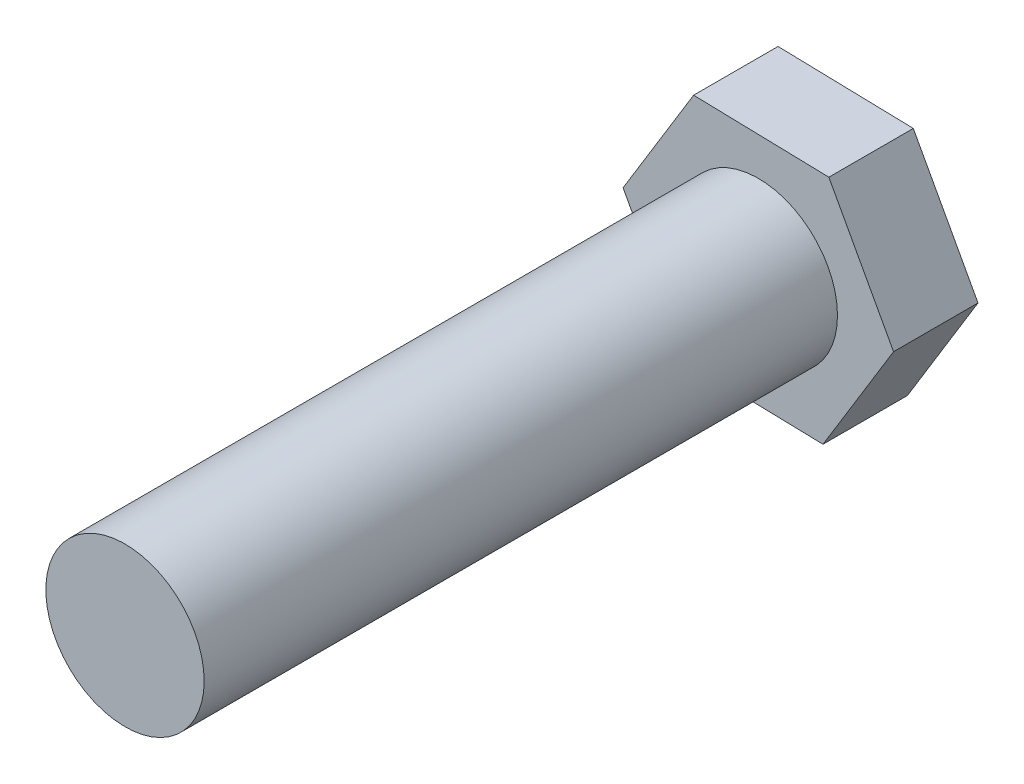
ISO-10303-21;
HEADER;
FILE_DESCRIPTION(('STEP AP214'),'2;1');
FILE_NAME('part.step','',(''),(''),'','','');
FILE_SCHEMA(('AUTOMOTIVE_DESIGN { 1 0 10303 214 1 1 1 1 }'));
ENDSEC;
DATA;
#1=APPLICATION_CONTEXT('core data for automotive mechanical design processes');
#2=APPLICATION_PROTOCOL_DEFINITION('international standard','automotive_design',2000,#1);
#3=PRODUCT_CONTEXT('',#1,'mechanical');
#4=PRODUCT('Part','Part','',(#3));
#5=PRODUCT_RELATED_PRODUCT_CATEGORY('part','',(#4));
#6=PRODUCT_DEFINITION_FORMATION('','',#4);
#7=PRODUCT_DEFINITION_CONTEXT('part definition',#1,'design');
#8=PRODUCT_DEFINITION('design','',#6,#7);
#9=PRODUCT_DEFINITION_SHAPE('','',#8);
#10=(LENGTH_UNIT() NAMED_UNIT(*) SI_UNIT(.MILLI.,.METRE.));
#11=(NAMED_UNIT(*) PLANE_ANGLE_UNIT() SI_UNIT($,.RADIAN.));
#12=(NAMED_UNIT(*) SI_UNIT($,.STERADIAN.) SOLID_ANGLE_UNIT());
#13=UNCERTAINTY_MEASURE_WITH_UNIT(LENGTH_MEASURE(1.E-05),#10,'distance_accuracy_value','');
#14=(GEOMETRIC_REPRESENTATION_CONTEXT(3) GLOBAL_UNCERTAINTY_ASSIGNED_CONTEXT((#13)) GLOBAL_UNIT_ASSIGNED_CONTEXT((#10,
#11,#12)) REPRESENTATION_CONTEXT('',''));
#15=CARTESIAN_POINT('',(0.,0.,0.));
#16=DIRECTION('',(0.,0.,1.));
#17=DIRECTION('',(1.,0.,0.));
#18=AXIS2_PLACEMENT_3D('',#15,#16,#17);
#19=CARTESIAN_POINT('',(8.13636466110673,-0.203403789280373,43.18));
#20=DIRECTION('',(-0.878250680315167,-0.478200525434619,0.));
#21=DIRECTION('',(0.478200525434619,-0.878250680315167,0.));
#22=AXIS2_PLACEMENT_3D('',#19,#20,#21);
#23=PLANE('',#22);
#24=DIRECTION('',(-0.478200525434619,0.878250680315167,0.));
#25=VECTOR('',#24,1.);
#26=CARTESIAN_POINT('',(8.13636466110673,-0.203403789280373,5.07999999999999));
#27=LINE('',#26,#25);
#28=CARTESIAN_POINT('',(8.13636466110673,-0.203403789280373,5.07999999999999));
#29=VERTEX_POINT('',#28);
#30=CARTESIAN_POINT('',(4.24433517929619,6.9445965963322,5.07999999999999));
#31=VERTEX_POINT('',#30);
#32=EDGE_CURVE('E83',#29,#31,#27,.T.);
#33=ORIENTED_EDGE('',*,*,#32,.F.);
#34=DIRECTION('',(0.,0.,-1.));
#35=VECTOR('',#34,1.);
#36=CARTESIAN_POINT('',(8.13636466110673,-0.203403789280373,43.18));
#37=LINE('',#36,#35);
#38=CARTESIAN_POINT('',(8.13636466110673,-0.203403789280373,0.));
#39=VERTEX_POINT('',#38);
#40=EDGE_CURVE('E53',#29,#39,#37,.T.);
#41=ORIENTED_EDGE('',*,*,#40,.T.);
#42=DIRECTION('',(-0.478200525434619,0.878250680315167,0.));
#43=VECTOR('',#42,1.);
#44=CARTESIAN_POINT('',(8.13636466110673,-0.203403789280373,0.));
#45=LINE('',#44,#43);
#46=CARTESIAN_POINT('',(4.24433517929619,6.9445965963322,0.));
#47=VERTEX_POINT('',#46);
#48=EDGE_CURVE('E88',#39,#47,#45,.T.);
#49=ORIENTED_EDGE('',*,*,#48,.T.);
#50=DIRECTION('',(0.,0.,-1.));
#51=VECTOR('',#50,1.);
#52=CARTESIAN_POINT('',(4.24433517929619,6.9445965963322,43.18));
#53=LINE('',#52,#51);
#54=EDGE_CURVE('E39',#31,#47,#53,.T.);
#55=ORIENTED_EDGE('',*,*,#54,.F.);
#56=EDGE_LOOP('',(#33,#41,#49,#55));
#57=FACE_BOUND('',#56,.T.);
#58=ADVANCED_FACE('F32',(#57),#23,.F.);
#59=CARTESIAN_POINT('',(4.24433517929619,6.9445965963322,43.18));
#60=DIRECTION('',(-0.0249915370281371,-0.99968766276121,0.));
#61=DIRECTION('',(0.99968766276121,-0.0249915370281371,0.));
#62=AXIS2_PLACEMENT_3D('',#59,#60,#61);
#63=PLANE('',#62);
#64=DIRECTION('',(-0.99968766276121,0.0249915370281371,0.));
#65=VECTOR('',#64,1.);
#66=CARTESIAN_POINT('',(4.24433517929619,6.9445965963322,5.07999999999999));
#67=LINE('',#66,#65);
#68=CARTESIAN_POINT('',(-3.89202948181054,7.14800038561258,5.07999999999999));
#69=VERTEX_POINT('',#68);
#70=EDGE_CURVE('E89',#31,#69,#67,.T.);
#71=ORIENTED_EDGE('',*,*,#70,.F.);
#72=ORIENTED_EDGE('',*,*,#54,.T.);
#73=DIRECTION('',(-0.99968766276121,0.0249915370281371,0.));
#74=VECTOR('',#73,1.);
#75=CARTESIAN_POINT('',(4.24433517929619,6.9445965963322,0.));
#76=LINE('',#75,#74);
#77=CARTESIAN_POINT('',(-3.89202948181054,7.14800038561258,0.));
#78=VERTEX_POINT('',#77);
#79=EDGE_CURVE('E112',#47,#78,#76,.T.);
#80=ORIENTED_EDGE('',*,*,#79,.T.);
#81=DIRECTION('',(0.,0.,-1.));
#82=VECTOR('',#81,1.);
#83=CARTESIAN_POINT('',(-3.89202948181054,7.14800038561258,43.18));
#84=LINE('',#83,#82);
#85=EDGE_CURVE('E106',#69,#78,#84,.T.);
#86=ORIENTED_EDGE('',*,*,#85,.F.);
#87=EDGE_LOOP('',(#71,#72,#80,#86));
#88=FACE_BOUND('',#87,.T.);
#89=ADVANCED_FACE('F110',(#88),#63,.F.);
#90=CARTESIAN_POINT('',(-3.89202948181054,7.14800038561258,43.18));
#91=DIRECTION('',(0.853259143287031,-0.521487137326591,0.));
#92=DIRECTION('',(0.521487137326591,0.853259143287031,0.));
#93=AXIS2_PLACEMENT_3D('',#90,#91,#92);
#94=PLANE('',#93);
#95=DIRECTION('',(-0.521487137326591,-0.853259143287031,0.));
#96=VECTOR('',#95,1.);
#97=CARTESIAN_POINT('',(-3.89202948181054,7.14800038561258,5.07999999999999));
#98=LINE('',#97,#96);
#99=CARTESIAN_POINT('',(-8.13636466110673,0.203403789280373,5.07999999999999));
#100=VERTEX_POINT('',#99);
#101=EDGE_CURVE('E139',#69,#100,#98,.T.);
#102=ORIENTED_EDGE('',*,*,#101,.F.);
#103=ORIENTED_EDGE('',*,*,#85,.T.);
#104=DIRECTION('',(-0.521487137326591,-0.853259143287031,0.));
#105=VECTOR('',#104,1.);
#106=CARTESIAN_POINT('',(-3.89202948181054,7.14800038561258,0.));
#107=LINE('',#106,#105);
#108=CARTESIAN_POINT('',(-8.13636466110673,0.203403789280373,0.));
#109=VERTEX_POINT('',#108);
#110=EDGE_CURVE('E118',#78,#109,#107,.T.);
#111=ORIENTED_EDGE('',*,*,#110,.T.);
#112=DIRECTION('',(0.,0.,-1.));
#113=VECTOR('',#112,1.);
#114=CARTESIAN_POINT('',(-8.13636466110673,0.203403789280373,43.18));
#115=LINE('',#114,#113);
#116=EDGE_CURVE('E104',#100,#109,#115,.T.);
#117=ORIENTED_EDGE('',*,*,#116,.F.);
#118=EDGE_LOOP('',(#102,#103,#111,#117));
#119=FACE_BOUND('',#118,.T.);
#120=ADVANCED_FACE('F138',(#119),#94,.F.);
#121=CARTESIAN_POINT('',(-8.13636466110673,0.203403789280373,43.18));
#122=DIRECTION('',(0.878250680315167,0.47820052543462,0.));
#123=DIRECTION('',(-0.47820052543462,0.878250680315167,0.));
#124=AXIS2_PLACEMENT_3D('',#121,#122,#123);
#125=PLANE('',#124);
#126=DIRECTION('',(0.47820052543462,-0.878250680315167,0.));
#127=VECTOR('',#126,1.);
#128=CARTESIAN_POINT('',(-8.13636466110673,0.203403789280373,5.07999999999999));
#129=LINE('',#128,#127);
#130=CARTESIAN_POINT('',(-4.24433517929618,-6.9445965963322,5.07999999999999));
#131=VERTEX_POINT('',#130);
#132=EDGE_CURVE('E135',#100,#131,#129,.T.);
#133=ORIENTED_EDGE('',*,*,#132,.F.);
#134=ORIENTED_EDGE('',*,*,#116,.T.);
#135=DIRECTION('',(0.47820052543462,-0.878250680315167,0.));
#136=VECTOR('',#135,1.);
#137=CARTESIAN_POINT('',(-8.13636466110673,0.203403789280373,0.));
#138=LINE('',#137,#136);
#139=CARTESIAN_POINT('',(-4.24433517929618,-6.9445965963322,0.));
#140=VERTEX_POINT('',#139);
#141=EDGE_CURVE('E124',#109,#140,#138,.T.);
#142=ORIENTED_EDGE('',*,*,#141,.T.);
#143=DIRECTION('',(0.,0.,-1.));
#144=VECTOR('',#143,1.);
#145=CARTESIAN_POINT('',(-4.24433517929618,-6.9445965963322,43.18));
#146=LINE('',#145,#144);
#147=EDGE_CURVE('E97',#131,#140,#146,.T.);
#148=ORIENTED_EDGE('',*,*,#147,.F.);
#149=EDGE_LOOP('',(#133,#134,#142,#148));
#150=FACE_BOUND('',#149,.T.);
#151=ADVANCED_FACE('F133',(#150),#125,.F.);
#152=CARTESIAN_POINT('',(-4.24433517929618,-6.9445965963322,43.18));
#153=DIRECTION('',(0.0249915370281367,0.99968766276121,0.));
#154=DIRECTION('',(-0.99968766276121,0.0249915370281367,0.));
#155=AXIS2_PLACEMENT_3D('',#152,#153,#154);
#156=PLANE('',#155);
#157=DIRECTION('',(0.99968766276121,-0.0249915370281367,0.));
#158=VECTOR('',#157,1.);
#159=CARTESIAN_POINT('',(-4.24433517929618,-6.9445965963322,5.07999999999999));
#160=LINE('',#159,#158);
#161=CARTESIAN_POINT('',(3.89202948181054,-7.14800038561258,5.07999999999999));
#162=VERTEX_POINT('',#161);
#163=EDGE_CURVE('E45',#131,#162,#160,.T.);
#164=ORIENTED_EDGE('',*,*,#163,.F.);
#165=ORIENTED_EDGE('',*,*,#147,.T.);
#166=DIRECTION('',(0.99968766276121,-0.0249915370281367,0.));
#167=VECTOR('',#166,1.);
#168=CARTESIAN_POINT('',(-4.24433517929618,-6.9445965963322,0.));
#169=LINE('',#168,#167);
#170=CARTESIAN_POINT('',(3.89202948181054,-7.14800038561258,0.));
#171=VERTEX_POINT('',#170);
#172=EDGE_CURVE('E99',#140,#171,#169,.T.);
#173=ORIENTED_EDGE('',*,*,#172,.T.);
#174=DIRECTION('',(0.,0.,-1.));
#175=VECTOR('',#174,1.);
#176=CARTESIAN_POINT('',(3.89202948181054,-7.14800038561258,43.18));
#177=LINE('',#176,#175);
#178=EDGE_CURVE('E95',#162,#171,#177,.T.);
#179=ORIENTED_EDGE('',*,*,#178,.F.);
#180=EDGE_LOOP('',(#164,#165,#173,#179));
#181=FACE_BOUND('',#180,.T.);
#182=ADVANCED_FACE('F129',(#181),#156,.F.);
#183=CARTESIAN_POINT('',(3.89202948181054,-7.14800038561258,43.18));
#184=DIRECTION('',(-0.853259143287031,0.521487137326591,0.));
#185=DIRECTION('',(-0.521487137326591,-0.853259143287031,0.));
#186=AXIS2_PLACEMENT_3D('',#183,#184,#185);
#187=PLANE('',#186);
#188=DIRECTION('',(0.521487137326591,0.85325914328703,0.));
#189=VECTOR('',#188,1.);
#190=CARTESIAN_POINT('',(3.89202948181054,-7.14800038561258,5.07999999999999));
#191=LINE('',#190,#189);
#192=EDGE_CURVE('E12',#162,#29,#191,.T.);
#193=ORIENTED_EDGE('',*,*,#192,.F.);
#194=ORIENTED_EDGE('',*,*,#178,.T.);
#195=DIRECTION('',(0.521487137326591,0.85325914328703,0.));
#196=VECTOR('',#195,1.);
#197=CARTESIAN_POINT('',(3.89202948181054,-7.14800038561258,0.));
#198=LINE('',#197,#196);
#199=EDGE_CURVE('E93',#171,#39,#198,.T.);
#200=ORIENTED_EDGE('',*,*,#199,.T.);
#201=ORIENTED_EDGE('',*,*,#40,.F.);
#202=EDGE_LOOP('',(#193,#194,#200,#201));
#203=FACE_BOUND('',#202,.T.);
#204=ADVANCED_FACE('F91',(#203),#187,.F.);
#205=CARTESIAN_POINT('',(4.24433517929619,6.9445965963322,0.));
#206=DIRECTION('',(0.,0.,1.));
#207=DIRECTION('',(1.,0.,0.));
#208=AXIS2_PLACEMENT_3D('',#205,#206,#207);
#209=PLANE('',#208);
#210=ORIENTED_EDGE('',*,*,#48,.F.);
#211=ORIENTED_EDGE('',*,*,#199,.F.);
#212=ORIENTED_EDGE('',*,*,#172,.F.);
#213=ORIENTED_EDGE('',*,*,#141,.F.);
#214=ORIENTED_EDGE('',*,*,#110,.F.);
#215=ORIENTED_EDGE('',*,*,#79,.F.);
#216=EDGE_LOOP('',(#210,#211,#212,#213,#214,#215));
#217=FACE_BOUND('',#216,.T.);
#218=ADVANCED_FACE('F115',(#217),#209,.F.);
#219=CARTESIAN_POINT('',(0.,0.,5.07999999999999));
#220=DIRECTION('',(0.,0.,1.));
#221=DIRECTION('',(1.,0.,0.));
#222=AXIS2_PLACEMENT_3D('',#219,#220,#221);
#223=PLANE('',#222);
#224=CARTESIAN_POINT('',(0.,0.,5.07999999999999));
#225=DIRECTION('',(0.,0.,1.));
#226=DIRECTION('',(1.,0.,0.));
#227=AXIS2_PLACEMENT_3D('',#224,#225,#226);
#228=CIRCLE('',#227,4.7625);
#229=CARTESIAN_POINT('',(4.7625,0.,5.07999999999999));
#230=VERTEX_POINT('',#229);
#231=EDGE_CURVE('E144',#230,#230,#228,.T.);
#232=ORIENTED_EDGE('',*,*,#231,.F.);
#233=EDGE_LOOP('',(#232));
#234=FACE_BOUND('',#233,.T.);
#235=ORIENTED_EDGE('',*,*,#32,.T.);
#236=ORIENTED_EDGE('',*,*,#70,.T.);
#237=ORIENTED_EDGE('',*,*,#101,.T.);
#238=ORIENTED_EDGE('',*,*,#132,.T.);
#239=ORIENTED_EDGE('',*,*,#163,.T.);
#240=ORIENTED_EDGE('',*,*,#192,.T.);
#241=EDGE_LOOP('',(#235,#236,#237,#238,#239,#240));
#242=FACE_BOUND('',#241,.T.);
#243=ADVANCED_FACE('F82',(#234,#242),#223,.T.);
#244=CARTESIAN_POINT('',(0.,0.,5.07999999999999));
#245=DIRECTION('',(0.,0.,1.));
#246=DIRECTION('',(1.,0.,0.));
#247=AXIS2_PLACEMENT_3D('',#244,#245,#246);
#248=CYLINDRICAL_SURFACE('',#247,4.7625);
#249=ORIENTED_EDGE('',*,*,#231,.T.);
#250=EDGE_LOOP('',(#249));
#251=FACE_BOUND('',#250,.T.);
#252=CARTESIAN_POINT('',(0.,0.,43.18));
#253=DIRECTION('',(0.,0.,1.));
#254=DIRECTION('',(1.,0.,0.));
#255=AXIS2_PLACEMENT_3D('',#252,#253,#254);
#256=CIRCLE('',#255,4.7625);
#257=CARTESIAN_POINT('',(4.7625,0.,43.18));
#258=VERTEX_POINT('',#257);
#259=EDGE_CURVE('E145',#258,#258,#256,.T.);
#260=ORIENTED_EDGE('',*,*,#259,.F.);
#261=EDGE_LOOP('',(#260));
#262=FACE_BOUND('',#261,.T.);
#263=ADVANCED_FACE('F151',(#251,#262),#248,.T.);
#264=CARTESIAN_POINT('',(4.24433517929619,6.9445965963322,43.18));
#265=DIRECTION('',(0.,0.,1.));
#266=DIRECTION('',(1.,0.,0.));
#267=AXIS2_PLACEMENT_3D('',#264,#265,#266);
#268=PLANE('',#267);
#269=ORIENTED_EDGE('',*,*,#259,.T.);
#270=EDGE_LOOP('',(#269));
#271=FACE_BOUND('',#270,.T.);
#272=ADVANCED_FACE('F160',(#271),#268,.T.);
#273=CLOSED_SHELL('',(#58,#89,#120,#151,#182,#204,#218,#243,#263,#272));
#274=MANIFOLD_SOLID_BREP('B2',#273);
#275=ADVANCED_BREP_SHAPE_REPRESENTATION('',(#18,#274),#14);
#276=SHAPE_DEFINITION_REPRESENTATION(#9,#275);
ENDSEC;
END-ISO-10303-21;
